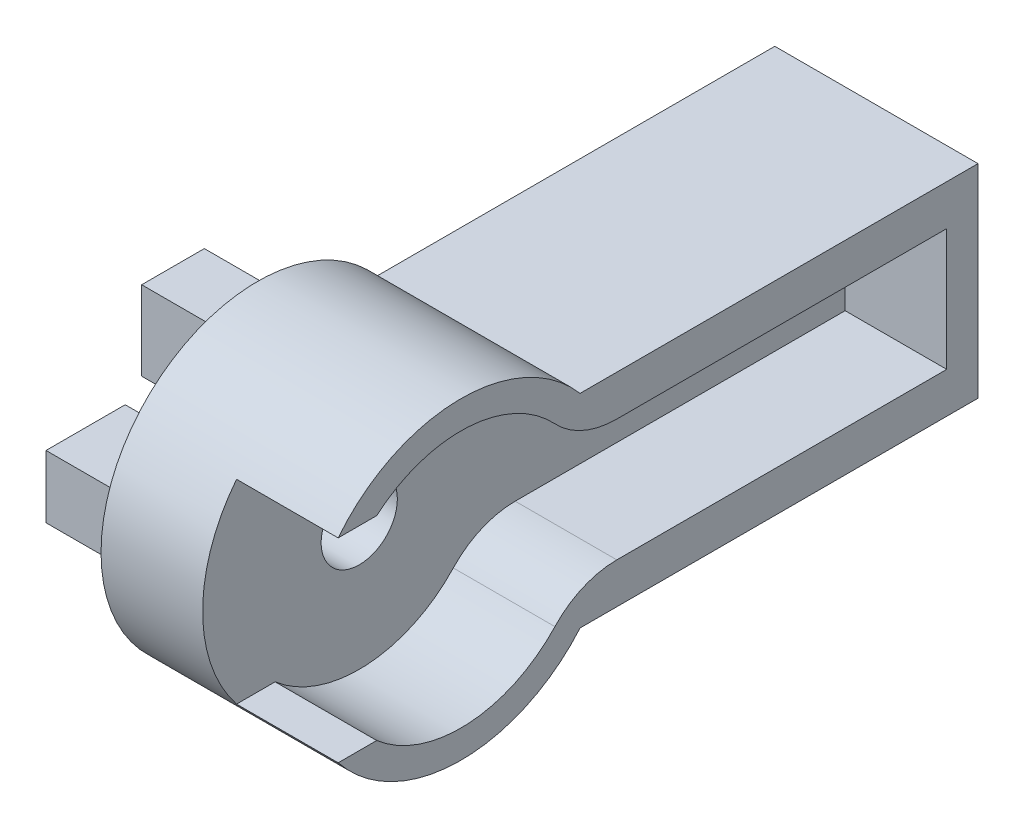
ISO-10303-21;
HEADER;
FILE_DESCRIPTION(('STEP AP214'),'2;1');
FILE_NAME('part.step','',(''),(''),'','','');
FILE_SCHEMA(('AUTOMOTIVE_DESIGN { 1 0 10303 214 1 1 1 1 }'));
ENDSEC;
DATA;
#1=APPLICATION_CONTEXT('core data for automotive mechanical design processes');
#2=APPLICATION_PROTOCOL_DEFINITION('international standard','automotive_design',2000,#1);
#3=PRODUCT_CONTEXT('',#1,'mechanical');
#4=PRODUCT('Part','Part','',(#3));
#5=PRODUCT_RELATED_PRODUCT_CATEGORY('part','',(#4));
#6=PRODUCT_DEFINITION_FORMATION('','',#4);
#7=PRODUCT_DEFINITION_CONTEXT('part definition',#1,'design');
#8=PRODUCT_DEFINITION('design','',#6,#7);
#9=PRODUCT_DEFINITION_SHAPE('','',#8);
#10=(LENGTH_UNIT() NAMED_UNIT(*) SI_UNIT(.MILLI.,.METRE.));
#11=(NAMED_UNIT(*) PLANE_ANGLE_UNIT() SI_UNIT($,.RADIAN.));
#12=(NAMED_UNIT(*) SI_UNIT($,.STERADIAN.) SOLID_ANGLE_UNIT());
#13=UNCERTAINTY_MEASURE_WITH_UNIT(LENGTH_MEASURE(1.E-05),#10,'distance_accuracy_value','');
#14=(GEOMETRIC_REPRESENTATION_CONTEXT(3) GLOBAL_UNCERTAINTY_ASSIGNED_CONTEXT((#13)) GLOBAL_UNIT_ASSIGNED_CONTEXT((#10,
#11,#12)) REPRESENTATION_CONTEXT('',''));
#15=CARTESIAN_POINT('',(0.,0.,0.));
#16=DIRECTION('',(0.,0.,1.));
#17=DIRECTION('',(1.,0.,0.));
#18=AXIS2_PLACEMENT_3D('',#15,#16,#17);
#19=CARTESIAN_POINT('',(-5.,0.,0.));
#20=DIRECTION('',(-1.,0.,0.));
#21=DIRECTION('',(0.,0.,1.));
#22=AXIS2_PLACEMENT_3D('',#19,#20,#21);
#23=PLANE('',#22);
#24=CARTESIAN_POINT('',(-5.,0.,0.));
#25=DIRECTION('',(-1.,0.,0.));
#26=DIRECTION('',(0.,0.,1.));
#27=AXIS2_PLACEMENT_3D('',#24,#25,#26);
#28=CIRCLE('',#27,3.375);
#29=CARTESIAN_POINT('',(-5.,2.82278674362765,1.85));
#30=VERTEX_POINT('',#29);
#31=CARTESIAN_POINT('',(-5.,2.82278674362765,-1.85));
#32=VERTEX_POINT('',#31);
#33=EDGE_CURVE('E12',#30,#32,#28,.T.);
#34=ORIENTED_EDGE('',*,*,#33,.F.);
#35=DIRECTION('',(0.,-1.,0.));
#36=VECTOR('',#35,1.);
#37=CARTESIAN_POINT('',(-5.,0.,1.85));
#38=LINE('',#37,#36);
#39=CARTESIAN_POINT('',(-5.,7.5,1.85));
#40=VERTEX_POINT('',#39);
#41=EDGE_CURVE('E353',#40,#30,#38,.T.);
#42=ORIENTED_EDGE('',*,*,#41,.F.);
#43=DIRECTION('',(0.,0.,1.));
#44=VECTOR('',#43,1.);
#45=CARTESIAN_POINT('',(-5.,7.5,0.));
#46=LINE('',#45,#44);
#47=CARTESIAN_POINT('',(-5.,7.5,-1.85));
#48=VERTEX_POINT('',#47);
#49=EDGE_CURVE('E359',#48,#40,#46,.T.);
#50=ORIENTED_EDGE('',*,*,#49,.F.);
#51=DIRECTION('',(0.,-1.,0.));
#52=VECTOR('',#51,1.);
#53=CARTESIAN_POINT('',(-5.,0.,-1.85));
#54=LINE('',#53,#52);
#55=EDGE_CURVE('E368',#48,#32,#54,.T.);
#56=ORIENTED_EDGE('',*,*,#55,.T.);
#57=EDGE_LOOP('',(#34,#42,#50,#56));
#58=FACE_BOUND('',#57,.T.);
#59=ADVANCED_FACE('F131',(#58),#23,.T.);
#60=CARTESIAN_POINT('',(-5.,1.85,-2.82278674362765));
#61=VERTEX_POINT('',#60);
#62=CARTESIAN_POINT('',(-5.,-1.85,-2.82278674362765));
#63=VERTEX_POINT('',#62);
#64=EDGE_CURVE('E141',#61,#63,#28,.T.);
#65=ORIENTED_EDGE('',*,*,#64,.F.);
#66=DIRECTION('',(0.,0.,1.));
#67=VECTOR('',#66,1.);
#68=CARTESIAN_POINT('',(-5.,1.85,0.));
#69=LINE('',#68,#67);
#70=CARTESIAN_POINT('',(-5.,1.85,-7.5));
#71=VERTEX_POINT('',#70);
#72=EDGE_CURVE('E372',#71,#61,#69,.T.);
#73=ORIENTED_EDGE('',*,*,#72,.F.);
#74=DIRECTION('',(0.,-1.,0.));
#75=VECTOR('',#74,1.);
#76=CARTESIAN_POINT('',(-5.,0.,-7.5));
#77=LINE('',#76,#75);
#78=CARTESIAN_POINT('',(-5.,-1.85,-7.5));
#79=VERTEX_POINT('',#78);
#80=EDGE_CURVE('E376',#71,#79,#77,.T.);
#81=ORIENTED_EDGE('',*,*,#80,.T.);
#82=DIRECTION('',(0.,0.,1.));
#83=VECTOR('',#82,1.);
#84=CARTESIAN_POINT('',(-5.,-1.85,0.));
#85=LINE('',#84,#83);
#86=EDGE_CURVE('E379',#79,#63,#85,.T.);
#87=ORIENTED_EDGE('',*,*,#86,.T.);
#88=EDGE_LOOP('',(#65,#73,#81,#87));
#89=FACE_BOUND('',#88,.T.);
#90=ADVANCED_FACE('F687',(#89),#23,.T.);
#91=CARTESIAN_POINT('',(-5.,-2.82278674362765,-1.85));
#92=VERTEX_POINT('',#91);
#93=CARTESIAN_POINT('',(-5.,-2.82278674362765,1.85));
#94=VERTEX_POINT('',#93);
#95=EDGE_CURVE('E335',#92,#94,#28,.T.);
#96=ORIENTED_EDGE('',*,*,#95,.F.);
#97=DIRECTION('',(0.,-1.,0.));
#98=VECTOR('',#97,1.);
#99=CARTESIAN_POINT('',(-5.,0.,-1.85));
#100=LINE('',#99,#98);
#101=CARTESIAN_POINT('',(-5.,-7.5,-1.85));
#102=VERTEX_POINT('',#101);
#103=EDGE_CURVE('E383',#92,#102,#100,.T.);
#104=ORIENTED_EDGE('',*,*,#103,.T.);
#105=DIRECTION('',(0.,0.,1.));
#106=VECTOR('',#105,1.);
#107=CARTESIAN_POINT('',(-5.,-7.5,0.));
#108=LINE('',#107,#106);
#109=CARTESIAN_POINT('',(-5.,-7.5,1.85));
#110=VERTEX_POINT('',#109);
#111=EDGE_CURVE('E386',#102,#110,#108,.T.);
#112=ORIENTED_EDGE('',*,*,#111,.T.);
#113=DIRECTION('',(0.,-1.,0.));
#114=VECTOR('',#113,1.);
#115=CARTESIAN_POINT('',(-5.,0.,1.85));
#116=LINE('',#115,#114);
#117=EDGE_CURVE('E390',#94,#110,#116,.T.);
#118=ORIENTED_EDGE('',*,*,#117,.F.);
#119=EDGE_LOOP('',(#96,#104,#112,#118));
#120=FACE_BOUND('',#119,.T.);
#121=ADVANCED_FACE('F694',(#120),#23,.T.);
#122=CARTESIAN_POINT('',(12.,0.,0.));
#123=DIRECTION('',(1.,0.,0.));
#124=DIRECTION('',(0.,0.,-1.));
#125=AXIS2_PLACEMENT_3D('',#122,#123,#124);
#126=PLANE('',#125);
#127=CARTESIAN_POINT('',(12.,0.,0.));
#128=DIRECTION('',(1.,0.,0.));
#129=DIRECTION('',(0.,0.,-1.));
#130=AXIS2_PLACEMENT_3D('',#127,#128,#129);
#131=CIRCLE('',#130,7.6);
#132=CARTESIAN_POINT('',(12.,5.18730158730159,-5.55444886936395));
#133=VERTEX_POINT('',#132);
#134=CARTESIAN_POINT('',(12.,5.75,4.9696579359147));
#135=VERTEX_POINT('',#134);
#136=EDGE_CURVE('E467',#133,#135,#131,.T.);
#137=ORIENTED_EDGE('',*,*,#136,.F.);
#138=CARTESIAN_POINT('',(12.,8.6,-9.20869154657707));
#139=DIRECTION('',(1.,0.,0.));
#140=DIRECTION('',(0.,0.,-1.));
#141=AXIS2_PLACEMENT_3D('',#138,#139,#140);
#142=CIRCLE('',#141,5.);
#143=CARTESIAN_POINT('',(12.,3.6,-9.20869154657707));
#144=VERTEX_POINT('',#143);
#145=EDGE_CURVE('E603',#133,#144,#142,.T.);
#146=ORIENTED_EDGE('',*,*,#145,.T.);
#147=DIRECTION('',(0.,0.,-1.));
#148=VECTOR('',#147,1.);
#149=CARTESIAN_POINT('',(12.,3.6,0.));
#150=LINE('',#149,#148);
#151=CARTESIAN_POINT('',(12.,3.6,-28.6932802122726));
#152=VERTEX_POINT('',#151);
#153=EDGE_CURVE('E495',#144,#152,#150,.T.);
#154=ORIENTED_EDGE('',*,*,#153,.T.);
#155=DIRECTION('',(0.,-1.,0.));
#156=VECTOR('',#155,1.);
#157=CARTESIAN_POINT('',(12.,0.,-28.6932802122726));
#158=LINE('',#157,#156);
#159=CARTESIAN_POINT('',(12.,-3.6,-28.6932802122726));
#160=VERTEX_POINT('',#159);
#161=EDGE_CURVE('E487',#152,#160,#158,.T.);
#162=ORIENTED_EDGE('',*,*,#161,.T.);
#163=DIRECTION('',(0.,0.,-1.));
#164=VECTOR('',#163,1.);
#165=CARTESIAN_POINT('',(12.,-3.6,0.));
#166=LINE('',#165,#164);
#167=CARTESIAN_POINT('',(12.,-3.6,-9.20869154657707));
#168=VERTEX_POINT('',#167);
#169=EDGE_CURVE('E498',#168,#160,#166,.T.);
#170=ORIENTED_EDGE('',*,*,#169,.F.);
#171=CARTESIAN_POINT('',(12.,-8.6,-9.20869154657707));
#172=DIRECTION('',(1.,0.,0.));
#173=DIRECTION('',(0.,0.,-1.));
#174=AXIS2_PLACEMENT_3D('',#171,#172,#173);
#175=CIRCLE('',#174,5.);
#176=CARTESIAN_POINT('',(12.,-5.18730158730159,-5.55444886936395));
#177=VERTEX_POINT('',#176);
#178=EDGE_CURVE('E600',#168,#177,#175,.T.);
#179=ORIENTED_EDGE('',*,*,#178,.T.);
#180=CARTESIAN_POINT('',(12.,-5.75,4.9696579359147));
#181=VERTEX_POINT('',#180);
#182=EDGE_CURVE('E539',#181,#177,#131,.T.);
#183=ORIENTED_EDGE('',*,*,#182,.F.);
#184=DIRECTION('',(0.,0.,1.));
#185=VECTOR('',#184,1.);
#186=CARTESIAN_POINT('',(12.,-5.75,4.9696579359147));
#187=LINE('',#186,#185);
#188=CARTESIAN_POINT('',(12.,-5.75,7.24568837309472));
#189=VERTEX_POINT('',#188);
#190=EDGE_CURVE('E523',#181,#189,#187,.T.);
#191=ORIENTED_EDGE('',*,*,#190,.T.);
#192=CARTESIAN_POINT('',(12.,0.,0.));
#193=DIRECTION('',(1.,0.,0.));
#194=DIRECTION('',(0.,0.,-1.));
#195=AXIS2_PLACEMENT_3D('',#192,#193,#194);
#196=CIRCLE('',#195,9.25);
#197=CARTESIAN_POINT('',(12.,-6.,-7.04006392016436));
#198=VERTEX_POINT('',#197);
#199=EDGE_CURVE('E583',#189,#198,#196,.T.);
#200=ORIENTED_EDGE('',*,*,#199,.T.);
#201=DIRECTION('',(0.,0.,-1.));
#202=VECTOR('',#201,1.);
#203=CARTESIAN_POINT('',(12.,-6.,0.));
#204=LINE('',#203,#202);
#205=CARTESIAN_POINT('',(12.,-6.,-30.5400639201644));
#206=VERTEX_POINT('',#205);
#207=EDGE_CURVE('E543',#198,#206,#204,.T.);
#208=ORIENTED_EDGE('',*,*,#207,.T.);
#209=DIRECTION('',(0.,-1.,0.));
#210=VECTOR('',#209,1.);
#211=CARTESIAN_POINT('',(12.,0.,-30.5400639201644));
#212=LINE('',#211,#210);
#213=CARTESIAN_POINT('',(12.,6.,-30.5400639201644));
#214=VERTEX_POINT('',#213);
#215=EDGE_CURVE('E546',#214,#206,#212,.T.);
#216=ORIENTED_EDGE('',*,*,#215,.F.);
#217=DIRECTION('',(0.,0.,-1.));
#218=VECTOR('',#217,1.);
#219=CARTESIAN_POINT('',(12.,6.,0.));
#220=LINE('',#219,#218);
#221=CARTESIAN_POINT('',(12.,6.,-7.04006392016436));
#222=VERTEX_POINT('',#221);
#223=EDGE_CURVE('E551',#222,#214,#220,.T.);
#224=ORIENTED_EDGE('',*,*,#223,.F.);
#225=CARTESIAN_POINT('',(12.,5.75,7.24568837309472));
#226=VERTEX_POINT('',#225);
#227=EDGE_CURVE('E561',#222,#226,#196,.T.);
#228=ORIENTED_EDGE('',*,*,#227,.T.);
#229=DIRECTION('',(0.,0.,1.));
#230=VECTOR('',#229,1.);
#231=CARTESIAN_POINT('',(12.,5.75,4.9696579359147));
#232=LINE('',#231,#230);
#233=EDGE_CURVE('E518',#135,#226,#232,.T.);
#234=ORIENTED_EDGE('',*,*,#233,.F.);
#235=EDGE_LOOP('',(#137,#146,#154,#162,#170,#179,#183,#191,#200,#208,#216,#224,#228,#234));
#236=FACE_BOUND('',#235,.T.);
#237=ADVANCED_FACE('F636',(#236),#126,.T.);
#238=CARTESIAN_POINT('',(12.,0.,0.));
#239=DIRECTION('',(-1.,0.,0.));
#240=DIRECTION('',(0.,0.,1.));
#241=AXIS2_PLACEMENT_3D('',#238,#239,#240);
#242=CYLINDRICAL_SURFACE('',#241,9.25);
#243=DIRECTION('',(-1.,0.,0.));
#244=VECTOR('',#243,1.);
#245=CARTESIAN_POINT('',(12.,-5.75,7.24568837309472));
#246=LINE('',#245,#244);
#247=CARTESIAN_POINT('',(6.,-5.75,7.24568837309472));
#248=VERTEX_POINT('',#247);
#249=EDGE_CURVE('E593',#248,#189,#246,.F.);
#250=ORIENTED_EDGE('',*,*,#249,.F.);
#251=CARTESIAN_POINT('',(6.,0.,0.));
#252=DIRECTION('',(1.,0.,0.));
#253=DIRECTION('',(0.,0.,-1.));
#254=AXIS2_PLACEMENT_3D('',#251,#252,#253);
#255=CIRCLE('',#254,9.25);
#256=CARTESIAN_POINT('',(6.,5.75,7.24568837309472));
#257=VERTEX_POINT('',#256);
#258=EDGE_CURVE('E590',#257,#248,#255,.T.);
#259=ORIENTED_EDGE('',*,*,#258,.F.);
#260=DIRECTION('',(-1.,0.,0.));
#261=VECTOR('',#260,1.);
#262=CARTESIAN_POINT('',(12.,5.75,7.24568837309472));
#263=LINE('',#262,#261);
#264=EDGE_CURVE('E579',#257,#226,#263,.F.);
#265=ORIENTED_EDGE('',*,*,#264,.T.);
#266=ORIENTED_EDGE('',*,*,#227,.F.);
#267=DIRECTION('',(-1.,0.,0.));
#268=VECTOR('',#267,1.);
#269=CARTESIAN_POINT('',(12.,6.,-7.04006392016436));
#270=LINE('',#269,#268);
#271=CARTESIAN_POINT('',(0.,6.,-7.04006392016436));
#272=VERTEX_POINT('',#271);
#273=EDGE_CURVE('E555',#222,#272,#270,.T.);
#274=ORIENTED_EDGE('',*,*,#273,.T.);
#275=CARTESIAN_POINT('',(0.,0.,0.));
#276=DIRECTION('',(1.,0.,0.));
#277=DIRECTION('',(0.,0.,-1.));
#278=AXIS2_PLACEMENT_3D('',#275,#276,#277);
#279=CIRCLE('',#278,9.25);
#280=CARTESIAN_POINT('',(0.,-6.,-7.04006392016436));
#281=VERTEX_POINT('',#280);
#282=EDGE_CURVE('E509',#272,#281,#279,.T.);
#283=ORIENTED_EDGE('',*,*,#282,.T.);
#284=DIRECTION('',(-1.,0.,0.));
#285=VECTOR('',#284,1.);
#286=CARTESIAN_POINT('',(12.,-6.,-7.04006392016436));
#287=LINE('',#286,#285);
#288=EDGE_CURVE('E576',#198,#281,#287,.T.);
#289=ORIENTED_EDGE('',*,*,#288,.F.);
#290=ORIENTED_EDGE('',*,*,#199,.F.);
#291=EDGE_LOOP('',(#250,#259,#265,#266,#274,#283,#289,#290));
#292=FACE_BOUND('',#291,.T.);
#293=ADVANCED_FACE('F646',(#292),#242,.T.);
#294=CARTESIAN_POINT('',(0.,0.,0.));
#295=DIRECTION('',(1.,0.,0.));
#296=DIRECTION('',(0.,0.,-1.));
#297=AXIS2_PLACEMENT_3D('',#294,#295,#296);
#298=PLANE('',#297);
#299=CARTESIAN_POINT('',(0.,0.,0.));
#300=DIRECTION('',(1.,0.,0.));
#301=DIRECTION('',(0.,0.,-1.));
#302=AXIS2_PLACEMENT_3D('',#299,#300,#301);
#303=CIRCLE('',#302,3.375);
#304=CARTESIAN_POINT('',(0.,2.82278674362765,1.85));
#305=VERTEX_POINT('',#304);
#306=CARTESIAN_POINT('',(0.,2.82278674362765,-1.85));
#307=VERTEX_POINT('',#306);
#308=EDGE_CURVE('E762',#305,#307,#303,.F.);
#309=ORIENTED_EDGE('',*,*,#308,.T.);
#310=DIRECTION('',(0.,-1.,0.));
#311=VECTOR('',#310,1.);
#312=CARTESIAN_POINT('',(0.,0.,-1.85));
#313=LINE('',#312,#311);
#314=CARTESIAN_POINT('',(0.,7.5,-1.85));
#315=VERTEX_POINT('',#314);
#316=EDGE_CURVE('E409',#315,#307,#313,.T.);
#317=ORIENTED_EDGE('',*,*,#316,.F.);
#318=DIRECTION('',(0.,0.,1.));
#319=VECTOR('',#318,1.);
#320=CARTESIAN_POINT('',(0.,7.5,0.));
#321=LINE('',#320,#319);
#322=CARTESIAN_POINT('',(0.,7.5,1.85));
#323=VERTEX_POINT('',#322);
#324=EDGE_CURVE('E405',#315,#323,#321,.T.);
#325=ORIENTED_EDGE('',*,*,#324,.T.);
#326=DIRECTION('',(0.,-1.,0.));
#327=VECTOR('',#326,1.);
#328=CARTESIAN_POINT('',(0.,0.,1.85));
#329=LINE('',#328,#327);
#330=EDGE_CURVE('E401',#323,#305,#329,.T.);
#331=ORIENTED_EDGE('',*,*,#330,.T.);
#332=EDGE_LOOP('',(#309,#317,#325,#331));
#333=FACE_BOUND('',#332,.T.);
#334=CARTESIAN_POINT('',(0.,-1.85,2.82278674362765));
#335=VERTEX_POINT('',#334);
#336=CARTESIAN_POINT('',(0.,1.85,2.82278674362765));
#337=VERTEX_POINT('',#336);
#338=EDGE_CURVE('E779',#335,#337,#303,.F.);
#339=ORIENTED_EDGE('',*,*,#338,.T.);
#340=DIRECTION('',(0.,0.,1.));
#341=VECTOR('',#340,1.);
#342=CARTESIAN_POINT('',(0.,1.85,0.));
#343=LINE('',#342,#341);
#344=CARTESIAN_POINT('',(0.,1.85,7.5));
#345=VERTEX_POINT('',#344);
#346=EDGE_CURVE('E343',#337,#345,#343,.T.);
#347=ORIENTED_EDGE('',*,*,#346,.T.);
#348=DIRECTION('',(0.,-1.,0.));
#349=VECTOR('',#348,1.);
#350=CARTESIAN_POINT('',(0.,0.,7.5));
#351=LINE('',#350,#349);
#352=CARTESIAN_POINT('',(0.,-1.85,7.5));
#353=VERTEX_POINT('',#352);
#354=EDGE_CURVE('E354',#345,#353,#351,.T.);
#355=ORIENTED_EDGE('',*,*,#354,.T.);
#356=DIRECTION('',(0.,0.,1.));
#357=VECTOR('',#356,1.);
#358=CARTESIAN_POINT('',(0.,-1.85,0.));
#359=LINE('',#358,#357);
#360=EDGE_CURVE('E155',#335,#353,#359,.T.);
#361=ORIENTED_EDGE('',*,*,#360,.F.);
#362=EDGE_LOOP('',(#339,#347,#355,#361));
#363=FACE_BOUND('',#362,.T.);
#364=CARTESIAN_POINT('',(0.,-2.82278674362765,-1.85));
#365=VERTEX_POINT('',#364);
#366=CARTESIAN_POINT('',(0.,-2.82278674362765,1.85));
#367=VERTEX_POINT('',#366);
#368=EDGE_CURVE('E744',#365,#367,#303,.F.);
#369=ORIENTED_EDGE('',*,*,#368,.T.);
#370=DIRECTION('',(0.,-1.,0.));
#371=VECTOR('',#370,1.);
#372=CARTESIAN_POINT('',(0.,0.,1.85));
#373=LINE('',#372,#371);
#374=CARTESIAN_POINT('',(0.,-7.5,1.85));
#375=VERTEX_POINT('',#374);
#376=EDGE_CURVE('E431',#367,#375,#373,.T.);
#377=ORIENTED_EDGE('',*,*,#376,.T.);
#378=DIRECTION('',(0.,0.,1.));
#379=VECTOR('',#378,1.);
#380=CARTESIAN_POINT('',(0.,-7.5,0.));
#381=LINE('',#380,#379);
#382=CARTESIAN_POINT('',(0.,-7.5,-1.85));
#383=VERTEX_POINT('',#382);
#384=EDGE_CURVE('E427',#383,#375,#381,.T.);
#385=ORIENTED_EDGE('',*,*,#384,.F.);
#386=DIRECTION('',(0.,-1.,0.));
#387=VECTOR('',#386,1.);
#388=CARTESIAN_POINT('',(0.,0.,-1.85));
#389=LINE('',#388,#387);
#390=EDGE_CURVE('E424',#365,#383,#389,.T.);
#391=ORIENTED_EDGE('',*,*,#390,.F.);
#392=EDGE_LOOP('',(#369,#377,#385,#391));
#393=FACE_BOUND('',#392,.T.);
#394=DIRECTION('',(0.,0.,1.));
#395=VECTOR('',#394,1.);
#396=CARTESIAN_POINT('',(0.,1.85,0.));
#397=LINE('',#396,#395);
#398=CARTESIAN_POINT('',(0.,1.85,-7.5));
#399=VERTEX_POINT('',#398);
#400=CARTESIAN_POINT('',(0.,1.85,-2.82278674362765));
#401=VERTEX_POINT('',#400);
#402=EDGE_CURVE('E413',#399,#401,#397,.T.);
#403=ORIENTED_EDGE('',*,*,#402,.T.);
#404=CARTESIAN_POINT('',(0.,-1.85,-2.82278674362765));
#405=VERTEX_POINT('',#404);
#406=EDGE_CURVE('E780',#401,#405,#303,.F.);
#407=ORIENTED_EDGE('',*,*,#406,.T.);
#408=DIRECTION('',(0.,0.,1.));
#409=VECTOR('',#408,1.);
#410=CARTESIAN_POINT('',(0.,-1.85,0.));
#411=LINE('',#410,#409);
#412=CARTESIAN_POINT('',(0.,-1.85,-7.5));
#413=VERTEX_POINT('',#412);
#414=EDGE_CURVE('E420',#413,#405,#411,.T.);
#415=ORIENTED_EDGE('',*,*,#414,.F.);
#416=DIRECTION('',(0.,-1.,0.));
#417=VECTOR('',#416,1.);
#418=CARTESIAN_POINT('',(0.,0.,-7.5));
#419=LINE('',#418,#417);
#420=EDGE_CURVE('E417',#399,#413,#419,.T.);
#421=ORIENTED_EDGE('',*,*,#420,.F.);
#422=EDGE_LOOP('',(#403,#407,#415,#421));
#423=FACE_BOUND('',#422,.T.);
#424=CARTESIAN_POINT('',(0.,0.,-20.5));
#425=DIRECTION('',(1.,0.,0.));
#426=DIRECTION('',(0.,0.,-1.));
#427=AXIS2_PLACEMENT_3D('',#424,#425,#426);
#428=CIRCLE('',#427,1.65);
#429=CARTESIAN_POINT('',(0.,0.,-22.15));
#430=VERTEX_POINT('',#429);
#431=EDGE_CURVE('E468',#430,#430,#428,.F.);
#432=ORIENTED_EDGE('',*,*,#431,.F.);
#433=EDGE_LOOP('',(#432));
#434=FACE_BOUND('',#433,.T.);
#435=CARTESIAN_POINT('',(0.,0.,-24.5));
#436=DIRECTION('',(1.,0.,0.));
#437=DIRECTION('',(0.,0.,-1.));
#438=AXIS2_PLACEMENT_3D('',#435,#436,#437);
#439=CIRCLE('',#438,1.65);
#440=CARTESIAN_POINT('',(0.,0.,-26.15));
#441=VERTEX_POINT('',#440);
#442=EDGE_CURVE('E473',#441,#441,#439,.F.);
#443=ORIENTED_EDGE('',*,*,#442,.F.);
#444=EDGE_LOOP('',(#443));
#445=FACE_BOUND('',#444,.T.);
#446=DIRECTION('',(0.,0.,-1.));
#447=VECTOR('',#446,1.);
#448=CARTESIAN_POINT('',(0.,-6.,0.));
#449=LINE('',#448,#447);
#450=CARTESIAN_POINT('',(0.,-6.,-30.5400639201644));
#451=VERTEX_POINT('',#450);
#452=EDGE_CURVE('E556',#281,#451,#449,.T.);
#453=ORIENTED_EDGE('',*,*,#452,.F.);
#454=ORIENTED_EDGE('',*,*,#282,.F.);
#455=DIRECTION('',(0.,0.,-1.));
#456=VECTOR('',#455,1.);
#457=CARTESIAN_POINT('',(0.,6.,0.));
#458=LINE('',#457,#456);
#459=CARTESIAN_POINT('',(0.,6.,-30.5400639201644));
#460=VERTEX_POINT('',#459);
#461=EDGE_CURVE('E547',#272,#460,#458,.T.);
#462=ORIENTED_EDGE('',*,*,#461,.T.);
#463=DIRECTION('',(0.,-1.,0.));
#464=VECTOR('',#463,1.);
#465=CARTESIAN_POINT('',(0.,0.,-30.5400639201644));
#466=LINE('',#465,#464);
#467=EDGE_CURVE('E560',#460,#451,#466,.T.);
#468=ORIENTED_EDGE('',*,*,#467,.T.);
#469=EDGE_LOOP('',(#453,#454,#462,#468));
#470=FACE_BOUND('',#469,.T.);
#471=CARTESIAN_POINT('',(0.,0.,0.));
#472=DIRECTION('',(1.,0.,0.));
#473=DIRECTION('',(0.,0.,-1.));
#474=AXIS2_PLACEMENT_3D('',#471,#472,#473);
#475=CIRCLE('',#474,2.25);
#476=CARTESIAN_POINT('',(0.,0.,-2.25));
#477=VERTEX_POINT('',#476);
#478=EDGE_CURVE('E345',#477,#477,#475,.F.);
#479=ORIENTED_EDGE('',*,*,#478,.F.);
#480=EDGE_LOOP('',(#479));
#481=FACE_BOUND('',#480,.T.);
#482=ADVANCED_FACE('F776',(#333,#363,#393,#423,#434,#445,#470,#481),#298,.F.);
#483=CARTESIAN_POINT('',(12.,-6.,0.));
#484=DIRECTION('',(0.,1.,0.));
#485=DIRECTION('',(0.,0.,1.));
#486=AXIS2_PLACEMENT_3D('',#483,#484,#485);
#487=PLANE('',#486);
#488=ORIENTED_EDGE('',*,*,#452,.T.);
#489=DIRECTION('',(-1.,0.,0.));
#490=VECTOR('',#489,1.);
#491=CARTESIAN_POINT('',(12.,-6.,-30.5400639201644));
#492=LINE('',#491,#490);
#493=EDGE_CURVE('E573',#206,#451,#492,.T.);
#494=ORIENTED_EDGE('',*,*,#493,.F.);
#495=ORIENTED_EDGE('',*,*,#207,.F.);
#496=ORIENTED_EDGE('',*,*,#288,.T.);
#497=EDGE_LOOP('',(#488,#494,#495,#496));
#498=FACE_BOUND('',#497,.T.);
#499=ADVANCED_FACE('F813',(#498),#487,.F.);
#500=CARTESIAN_POINT('',(12.,0.,-30.5400639201644));
#501=DIRECTION('',(0.,0.,-1.));
#502=DIRECTION('',(-1.,0.,0.));
#503=AXIS2_PLACEMENT_3D('',#500,#501,#502);
#504=PLANE('',#503);
#505=ORIENTED_EDGE('',*,*,#467,.F.);
#506=DIRECTION('',(-1.,0.,0.));
#507=VECTOR('',#506,1.);
#508=CARTESIAN_POINT('',(12.,6.,-30.5400639201644));
#509=LINE('',#508,#507);
#510=EDGE_CURVE('E570',#214,#460,#509,.T.);
#511=ORIENTED_EDGE('',*,*,#510,.F.);
#512=ORIENTED_EDGE('',*,*,#215,.T.);
#513=ORIENTED_EDGE('',*,*,#493,.T.);
#514=EDGE_LOOP('',(#505,#511,#512,#513));
#515=FACE_BOUND('',#514,.T.);
#516=ADVANCED_FACE('F815',(#515),#504,.T.);
#517=CARTESIAN_POINT('',(12.,6.,0.));
#518=DIRECTION('',(0.,1.,0.));
#519=DIRECTION('',(0.,0.,1.));
#520=AXIS2_PLACEMENT_3D('',#517,#518,#519);
#521=PLANE('',#520);
#522=ORIENTED_EDGE('',*,*,#461,.F.);
#523=ORIENTED_EDGE('',*,*,#273,.F.);
#524=ORIENTED_EDGE('',*,*,#223,.T.);
#525=ORIENTED_EDGE('',*,*,#510,.T.);
#526=EDGE_LOOP('',(#522,#523,#524,#525));
#527=FACE_BOUND('',#526,.T.);
#528=ADVANCED_FACE('F835',(#527),#521,.T.);
#529=CARTESIAN_POINT('',(6.,0.,0.));
#530=DIRECTION('',(1.,0.,0.));
#531=DIRECTION('',(0.,0.,-1.));
#532=AXIS2_PLACEMENT_3D('',#529,#530,#531);
#533=PLANE('',#532);
#534=CARTESIAN_POINT('',(6.,0.,0.));
#535=DIRECTION('',(1.,0.,0.));
#536=DIRECTION('',(0.,0.,-1.));
#537=AXIS2_PLACEMENT_3D('',#534,#535,#536);
#538=CIRCLE('',#537,2.25);
#539=CARTESIAN_POINT('',(6.,0.,-2.25));
#540=VERTEX_POINT('',#539);
#541=EDGE_CURVE('E463',#540,#540,#538,.T.);
#542=ORIENTED_EDGE('',*,*,#541,.F.);
#543=EDGE_LOOP('',(#542));
#544=FACE_BOUND('',#543,.T.);
#545=CARTESIAN_POINT('',(6.,0.,-20.5));
#546=DIRECTION('',(1.,0.,0.));
#547=DIRECTION('',(0.,0.,-1.));
#548=AXIS2_PLACEMENT_3D('',#545,#546,#547);
#549=CIRCLE('',#548,1.65);
#550=CARTESIAN_POINT('',(6.,0.,-22.15));
#551=VERTEX_POINT('',#550);
#552=EDGE_CURVE('E469',#551,#551,#549,.T.);
#553=ORIENTED_EDGE('',*,*,#552,.F.);
#554=EDGE_LOOP('',(#553));
#555=FACE_BOUND('',#554,.T.);
#556=CARTESIAN_POINT('',(6.,0.,-24.5));
#557=DIRECTION('',(1.,0.,0.));
#558=DIRECTION('',(0.,0.,-1.));
#559=AXIS2_PLACEMENT_3D('',#556,#557,#558);
#560=CIRCLE('',#559,1.65);
#561=CARTESIAN_POINT('',(6.,0.,-26.15));
#562=VERTEX_POINT('',#561);
#563=EDGE_CURVE('E462',#562,#562,#560,.T.);
#564=ORIENTED_EDGE('',*,*,#563,.F.);
#565=EDGE_LOOP('',(#564));
#566=FACE_BOUND('',#565,.T.);
#567=ORIENTED_EDGE('',*,*,#258,.T.);
#568=DIRECTION('',(0.,0.,1.));
#569=VECTOR('',#568,1.);
#570=CARTESIAN_POINT('',(6.,-5.75,4.9696579359147));
#571=LINE('',#570,#569);
#572=CARTESIAN_POINT('',(6.,-5.75,4.9696579359147));
#573=VERTEX_POINT('',#572);
#574=EDGE_CURVE('E513',#573,#248,#571,.T.);
#575=ORIENTED_EDGE('',*,*,#574,.F.);
#576=CARTESIAN_POINT('',(6.,0.,0.));
#577=DIRECTION('',(1.,0.,0.));
#578=DIRECTION('',(0.,0.,-1.));
#579=AXIS2_PLACEMENT_3D('',#576,#577,#578);
#580=CIRCLE('',#579,7.6);
#581=CARTESIAN_POINT('',(6.,-5.18730158730159,-5.55444886936395));
#582=VERTEX_POINT('',#581);
#583=EDGE_CURVE('E527',#573,#582,#580,.T.);
#584=ORIENTED_EDGE('',*,*,#583,.T.);
#585=CARTESIAN_POINT('',(6.,-8.6,-9.20869154657707));
#586=DIRECTION('',(1.,0.,0.));
#587=DIRECTION('',(0.,0.,-1.));
#588=AXIS2_PLACEMENT_3D('',#585,#586,#587);
#589=CIRCLE('',#588,5.);
#590=CARTESIAN_POINT('',(6.,-3.6,-9.20869154657707));
#591=VERTEX_POINT('',#590);
#592=EDGE_CURVE('E336',#582,#591,#589,.F.);
#593=ORIENTED_EDGE('',*,*,#592,.T.);
#594=DIRECTION('',(0.,0.,-1.));
#595=VECTOR('',#594,1.);
#596=CARTESIAN_POINT('',(6.,-3.6,0.));
#597=LINE('',#596,#595);
#598=CARTESIAN_POINT('',(6.,-3.6,-28.6932802122726));
#599=VERTEX_POINT('',#598);
#600=EDGE_CURVE('E486',#591,#599,#597,.T.);
#601=ORIENTED_EDGE('',*,*,#600,.T.);
#602=DIRECTION('',(0.,-1.,0.));
#603=VECTOR('',#602,1.);
#604=CARTESIAN_POINT('',(6.,0.,-28.6932802122726));
#605=LINE('',#604,#603);
#606=CARTESIAN_POINT('',(6.,3.6,-28.6932802122726));
#607=VERTEX_POINT('',#606);
#608=EDGE_CURVE('E490',#607,#599,#605,.T.);
#609=ORIENTED_EDGE('',*,*,#608,.F.);
#610=DIRECTION('',(0.,0.,-1.));
#611=VECTOR('',#610,1.);
#612=CARTESIAN_POINT('',(6.,3.6,0.));
#613=LINE('',#612,#611);
#614=CARTESIAN_POINT('',(6.,3.6,-9.20869154657707));
#615=VERTEX_POINT('',#614);
#616=EDGE_CURVE('E483',#615,#607,#613,.T.);
#617=ORIENTED_EDGE('',*,*,#616,.F.);
#618=CARTESIAN_POINT('',(6.,8.6,-9.20869154657707));
#619=DIRECTION('',(1.,0.,0.));
#620=DIRECTION('',(0.,0.,-1.));
#621=AXIS2_PLACEMENT_3D('',#618,#619,#620);
#622=CIRCLE('',#621,5.);
#623=CARTESIAN_POINT('',(6.,5.18730158730159,-5.55444886936395));
#624=VERTEX_POINT('',#623);
#625=EDGE_CURVE('E616',#615,#624,#622,.F.);
#626=ORIENTED_EDGE('',*,*,#625,.T.);
#627=CARTESIAN_POINT('',(6.,5.75,4.9696579359147));
#628=VERTEX_POINT('',#627);
#629=EDGE_CURVE('E538',#624,#628,#580,.T.);
#630=ORIENTED_EDGE('',*,*,#629,.T.);
#631=DIRECTION('',(0.,0.,1.));
#632=VECTOR('',#631,1.);
#633=CARTESIAN_POINT('',(6.,5.75,4.9696579359147));
#634=LINE('',#633,#632);
#635=EDGE_CURVE('E517',#628,#257,#634,.T.);
#636=ORIENTED_EDGE('',*,*,#635,.T.);
#637=EDGE_LOOP('',(#567,#575,#584,#593,#601,#609,#617,#626,#630,#636));
#638=FACE_BOUND('',#637,.T.);
#639=ADVANCED_FACE('F622',(#544,#555,#566,#638),#533,.T.);
#640=CARTESIAN_POINT('',(6.,-5.75,4.9696579359147));
#641=DIRECTION('',(0.,1.,0.));
#642=DIRECTION('',(0.,0.,1.));
#643=AXIS2_PLACEMENT_3D('',#640,#641,#642);
#644=PLANE('',#643);
#645=ORIENTED_EDGE('',*,*,#249,.T.);
#646=ORIENTED_EDGE('',*,*,#190,.F.);
#647=DIRECTION('',(1.,0.,0.));
#648=VECTOR('',#647,1.);
#649=CARTESIAN_POINT('',(6.,-5.75,4.9696579359147));
#650=LINE('',#649,#648);
#651=EDGE_CURVE('E522',#573,#181,#650,.T.);
#652=ORIENTED_EDGE('',*,*,#651,.F.);
#653=ORIENTED_EDGE('',*,*,#574,.T.);
#654=EDGE_LOOP('',(#645,#646,#652,#653));
#655=FACE_BOUND('',#654,.T.);
#656=ADVANCED_FACE('F641',(#655),#644,.T.);
#657=CARTESIAN_POINT('',(6.,5.75,4.9696579359147));
#658=DIRECTION('',(0.,1.,0.));
#659=DIRECTION('',(0.,0.,1.));
#660=AXIS2_PLACEMENT_3D('',#657,#658,#659);
#661=PLANE('',#660);
#662=ORIENTED_EDGE('',*,*,#635,.F.);
#663=DIRECTION('',(1.,0.,0.));
#664=VECTOR('',#663,1.);
#665=CARTESIAN_POINT('',(6.,5.75,4.9696579359147));
#666=LINE('',#665,#664);
#667=EDGE_CURVE('E499',#628,#135,#666,.T.);
#668=ORIENTED_EDGE('',*,*,#667,.T.);
#669=ORIENTED_EDGE('',*,*,#233,.T.);
#670=ORIENTED_EDGE('',*,*,#264,.F.);
#671=EDGE_LOOP('',(#662,#668,#669,#670));
#672=FACE_BOUND('',#671,.T.);
#673=ADVANCED_FACE('F660',(#672),#661,.F.);
#674=CARTESIAN_POINT('',(6.,3.6,0.));
#675=DIRECTION('',(0.,-1.,0.));
#676=DIRECTION('',(0.,0.,-1.));
#677=AXIS2_PLACEMENT_3D('',#674,#675,#676);
#678=PLANE('',#677);
#679=ORIENTED_EDGE('',*,*,#153,.F.);
#680=DIRECTION('',(-1.,0.,0.));
#681=VECTOR('',#680,1.);
#682=CARTESIAN_POINT('',(6.,3.6,-9.20869154657707));
#683=LINE('',#682,#681);
#684=EDGE_CURVE('E606',#144,#615,#683,.T.);
#685=ORIENTED_EDGE('',*,*,#684,.T.);
#686=ORIENTED_EDGE('',*,*,#616,.T.);
#687=DIRECTION('',(1.,0.,0.));
#688=VECTOR('',#687,1.);
#689=CARTESIAN_POINT('',(6.,3.6,-28.6932802122726));
#690=LINE('',#689,#688);
#691=EDGE_CURVE('E505',#607,#152,#690,.T.);
#692=ORIENTED_EDGE('',*,*,#691,.T.);
#693=EDGE_LOOP('',(#679,#685,#686,#692));
#694=FACE_BOUND('',#693,.T.);
#695=ADVANCED_FACE('F673',(#694),#678,.T.);
#696=CARTESIAN_POINT('',(6.,0.,-28.6932802122726));
#697=DIRECTION('',(0.,0.,1.));
#698=DIRECTION('',(1.,0.,0.));
#699=AXIS2_PLACEMENT_3D('',#696,#697,#698);
#700=PLANE('',#699);
#701=ORIENTED_EDGE('',*,*,#161,.F.);
#702=ORIENTED_EDGE('',*,*,#691,.F.);
#703=ORIENTED_EDGE('',*,*,#608,.T.);
#704=DIRECTION('',(1.,0.,0.));
#705=VECTOR('',#704,1.);
#706=CARTESIAN_POINT('',(6.,-3.6,-28.6932802122726));
#707=LINE('',#706,#705);
#708=EDGE_CURVE('E494',#599,#160,#707,.T.);
#709=ORIENTED_EDGE('',*,*,#708,.T.);
#710=EDGE_LOOP('',(#701,#702,#703,#709));
#711=FACE_BOUND('',#710,.T.);
#712=ADVANCED_FACE('F676',(#711),#700,.T.);
#713=CARTESIAN_POINT('',(6.,-3.6,0.));
#714=DIRECTION('',(0.,-1.,0.));
#715=DIRECTION('',(0.,0.,-1.));
#716=AXIS2_PLACEMENT_3D('',#713,#714,#715);
#717=PLANE('',#716);
#718=ORIENTED_EDGE('',*,*,#600,.F.);
#719=DIRECTION('',(1.,0.,0.));
#720=VECTOR('',#719,1.);
#721=CARTESIAN_POINT('',(6.,-3.6,-9.20869154657707));
#722=LINE('',#721,#720);
#723=EDGE_CURVE('E609',#591,#168,#722,.T.);
#724=ORIENTED_EDGE('',*,*,#723,.T.);
#725=ORIENTED_EDGE('',*,*,#169,.T.);
#726=ORIENTED_EDGE('',*,*,#708,.F.);
#727=EDGE_LOOP('',(#718,#724,#725,#726));
#728=FACE_BOUND('',#727,.T.);
#729=ADVANCED_FACE('F631',(#728),#717,.F.);
#730=CARTESIAN_POINT('',(6.,0.,0.));
#731=DIRECTION('',(1.,0.,0.));
#732=DIRECTION('',(0.,0.,-1.));
#733=AXIS2_PLACEMENT_3D('',#730,#731,#732);
#734=CYLINDRICAL_SURFACE('',#733,7.6);
#735=ORIENTED_EDGE('',*,*,#182,.T.);
#736=DIRECTION('',(1.,0.,0.));
#737=VECTOR('',#736,1.);
#738=CARTESIAN_POINT('',(6.,-5.18730158730159,-5.55444886936395));
#739=LINE('',#738,#737);
#740=EDGE_CURVE('E613',#177,#582,#739,.F.);
#741=ORIENTED_EDGE('',*,*,#740,.T.);
#742=ORIENTED_EDGE('',*,*,#583,.F.);
#743=ORIENTED_EDGE('',*,*,#651,.T.);
#744=EDGE_LOOP('',(#735,#741,#742,#743));
#745=FACE_BOUND('',#744,.T.);
#746=ADVANCED_FACE('F638',(#745),#734,.F.);
#747=ORIENTED_EDGE('',*,*,#629,.F.);
#748=DIRECTION('',(1.,0.,0.));
#749=VECTOR('',#748,1.);
#750=CARTESIAN_POINT('',(6.,5.18730158730159,-5.55444886936395));
#751=LINE('',#750,#749);
#752=EDGE_CURVE('E596',#624,#133,#751,.T.);
#753=ORIENTED_EDGE('',*,*,#752,.T.);
#754=ORIENTED_EDGE('',*,*,#136,.T.);
#755=ORIENTED_EDGE('',*,*,#667,.F.);
#756=EDGE_LOOP('',(#747,#753,#754,#755));
#757=FACE_BOUND('',#756,.T.);
#758=ADVANCED_FACE('F655',(#757),#734,.F.);
#759=CARTESIAN_POINT('',(6.,8.6,-9.20869154657707));
#760=DIRECTION('',(1.,0.,0.));
#761=DIRECTION('',(0.,0.,-1.));
#762=AXIS2_PLACEMENT_3D('',#759,#760,#761);
#763=CYLINDRICAL_SURFACE('',#762,5.);
#764=ORIENTED_EDGE('',*,*,#625,.F.);
#765=ORIENTED_EDGE('',*,*,#684,.F.);
#766=ORIENTED_EDGE('',*,*,#145,.F.);
#767=ORIENTED_EDGE('',*,*,#752,.F.);
#768=EDGE_LOOP('',(#764,#765,#766,#767));
#769=FACE_BOUND('',#768,.T.);
#770=ADVANCED_FACE('F668',(#769),#763,.T.);
#771=CARTESIAN_POINT('',(6.,-8.6,-9.20869154657707));
#772=DIRECTION('',(1.,0.,0.));
#773=DIRECTION('',(0.,0.,-1.));
#774=AXIS2_PLACEMENT_3D('',#771,#772,#773);
#775=CYLINDRICAL_SURFACE('',#774,5.);
#776=ORIENTED_EDGE('',*,*,#592,.F.);
#777=ORIENTED_EDGE('',*,*,#740,.F.);
#778=ORIENTED_EDGE('',*,*,#178,.F.);
#779=ORIENTED_EDGE('',*,*,#723,.F.);
#780=EDGE_LOOP('',(#776,#777,#778,#779));
#781=FACE_BOUND('',#780,.T.);
#782=ADVANCED_FACE('F133',(#781),#775,.T.);
#783=CARTESIAN_POINT('',(-6.36396103067893,0.,-24.5));
#784=DIRECTION('',(1.,0.,0.));
#785=DIRECTION('',(0.,0.,-1.));
#786=AXIS2_PLACEMENT_3D('',#783,#784,#785);
#787=CYLINDRICAL_SURFACE('',#786,1.65);
#788=ORIENTED_EDGE('',*,*,#442,.T.);
#789=EDGE_LOOP('',(#788));
#790=FACE_BOUND('',#789,.T.);
#791=ORIENTED_EDGE('',*,*,#563,.T.);
#792=EDGE_LOOP('',(#791));
#793=FACE_BOUND('',#792,.T.);
#794=ADVANCED_FACE('F840',(#790,#793),#787,.F.);
#795=CARTESIAN_POINT('',(-6.36396103067893,0.,-20.5));
#796=DIRECTION('',(1.,0.,0.));
#797=DIRECTION('',(0.,0.,-1.));
#798=AXIS2_PLACEMENT_3D('',#795,#796,#797);
#799=CYLINDRICAL_SURFACE('',#798,1.65);
#800=ORIENTED_EDGE('',*,*,#431,.T.);
#801=EDGE_LOOP('',(#800));
#802=FACE_BOUND('',#801,.T.);
#803=ORIENTED_EDGE('',*,*,#552,.T.);
#804=EDGE_LOOP('',(#803));
#805=FACE_BOUND('',#804,.T.);
#806=ADVANCED_FACE('F829',(#802,#805),#799,.F.);
#807=CARTESIAN_POINT('',(-6.36396103067893,0.,0.));
#808=DIRECTION('',(1.,0.,0.));
#809=DIRECTION('',(0.,0.,-1.));
#810=AXIS2_PLACEMENT_3D('',#807,#808,#809);
#811=CYLINDRICAL_SURFACE('',#810,2.25);
#812=ORIENTED_EDGE('',*,*,#478,.T.);
#813=EDGE_LOOP('',(#812));
#814=FACE_BOUND('',#813,.T.);
#815=ORIENTED_EDGE('',*,*,#541,.T.);
#816=EDGE_LOOP('',(#815));
#817=FACE_BOUND('',#816,.T.);
#818=ADVANCED_FACE('F826',(#814,#817),#811,.F.);
#819=CARTESIAN_POINT('',(-5.,1.85,0.));
#820=DIRECTION('',(0.,1.,0.));
#821=DIRECTION('',(0.,0.,1.));
#822=AXIS2_PLACEMENT_3D('',#819,#820,#821);
#823=PLANE('',#822);
#824=DIRECTION('',(-1.,0.,0.));
#825=VECTOR('',#824,1.);
#826=CARTESIAN_POINT('',(9.54594154601839,1.85,2.82278674362765));
#827=LINE('',#826,#825);
#828=CARTESIAN_POINT('',(-5.,1.85,2.82278674362765));
#829=VERTEX_POINT('',#828);
#830=EDGE_CURVE('E329',#829,#337,#827,.F.);
#831=ORIENTED_EDGE('',*,*,#830,.F.);
#832=DIRECTION('',(0.,0.,1.));
#833=VECTOR('',#832,1.);
#834=CARTESIAN_POINT('',(-5.,1.85,0.));
#835=LINE('',#834,#833);
#836=CARTESIAN_POINT('',(-5.,1.85,7.5));
#837=VERTEX_POINT('',#836);
#838=EDGE_CURVE('E341',#829,#837,#835,.T.);
#839=ORIENTED_EDGE('',*,*,#838,.T.);
#840=DIRECTION('',(1.,0.,0.));
#841=VECTOR('',#840,1.);
#842=CARTESIAN_POINT('',(-5.,1.85,7.5));
#843=LINE('',#842,#841);
#844=EDGE_CURVE('E398',#837,#345,#843,.T.);
#845=ORIENTED_EDGE('',*,*,#844,.T.);
#846=ORIENTED_EDGE('',*,*,#346,.F.);
#847=EDGE_LOOP('',(#831,#839,#845,#846));
#848=FACE_BOUND('',#847,.T.);
#849=ADVANCED_FACE('F339',(#848),#823,.T.);
#850=CARTESIAN_POINT('',(-5.,0.,1.85));
#851=DIRECTION('',(0.,0.,1.));
#852=DIRECTION('',(0.,-1.,0.));
#853=AXIS2_PLACEMENT_3D('',#850,#851,#852);
#854=PLANE('',#853);
#855=DIRECTION('',(-1.,0.,0.));
#856=VECTOR('',#855,1.);
#857=CARTESIAN_POINT('',(9.54594154601839,2.82278674362765,1.85));
#858=LINE('',#857,#856);
#859=EDGE_CURVE('E346',#305,#30,#858,.T.);
#860=ORIENTED_EDGE('',*,*,#859,.F.);
#861=ORIENTED_EDGE('',*,*,#330,.F.);
#862=DIRECTION('',(1.,0.,0.));
#863=VECTOR('',#862,1.);
#864=CARTESIAN_POINT('',(-5.,7.5,1.85));
#865=LINE('',#864,#863);
#866=EDGE_CURVE('E459',#40,#323,#865,.T.);
#867=ORIENTED_EDGE('',*,*,#866,.F.);
#868=ORIENTED_EDGE('',*,*,#41,.T.);
#869=EDGE_LOOP('',(#860,#861,#867,#868));
#870=FACE_BOUND('',#869,.T.);
#871=ADVANCED_FACE('F768',(#870),#854,.T.);
#872=CARTESIAN_POINT('',(-5.,7.5,0.));
#873=DIRECTION('',(0.,1.,0.));
#874=DIRECTION('',(0.,0.,1.));
#875=AXIS2_PLACEMENT_3D('',#872,#873,#874);
#876=PLANE('',#875);
#877=ORIENTED_EDGE('',*,*,#324,.F.);
#878=DIRECTION('',(1.,0.,0.));
#879=VECTOR('',#878,1.);
#880=CARTESIAN_POINT('',(-5.,7.5,-1.85));
#881=LINE('',#880,#879);
#882=EDGE_CURVE('E456',#48,#315,#881,.T.);
#883=ORIENTED_EDGE('',*,*,#882,.F.);
#884=ORIENTED_EDGE('',*,*,#49,.T.);
#885=ORIENTED_EDGE('',*,*,#866,.T.);
#886=EDGE_LOOP('',(#877,#883,#884,#885));
#887=FACE_BOUND('',#886,.T.);
#888=ADVANCED_FACE('F771',(#887),#876,.T.);
#889=CARTESIAN_POINT('',(-5.,0.,-1.85));
#890=DIRECTION('',(0.,0.,1.));
#891=DIRECTION('',(0.,-1.,0.));
#892=AXIS2_PLACEMENT_3D('',#889,#890,#891);
#893=PLANE('',#892);
#894=ORIENTED_EDGE('',*,*,#316,.T.);
#895=DIRECTION('',(-1.,0.,0.));
#896=VECTOR('',#895,1.);
#897=CARTESIAN_POINT('',(9.54594154601839,2.82278674362765,-1.85));
#898=LINE('',#897,#896);
#899=EDGE_CURVE('E754',#307,#32,#898,.T.);
#900=ORIENTED_EDGE('',*,*,#899,.T.);
#901=ORIENTED_EDGE('',*,*,#55,.F.);
#902=ORIENTED_EDGE('',*,*,#882,.T.);
#903=EDGE_LOOP('',(#894,#900,#901,#902));
#904=FACE_BOUND('',#903,.T.);
#905=ADVANCED_FACE('F774',(#904),#893,.F.);
#906=CARTESIAN_POINT('',(-5.,1.85,0.));
#907=DIRECTION('',(0.,1.,0.));
#908=DIRECTION('',(0.,0.,1.));
#909=AXIS2_PLACEMENT_3D('',#906,#907,#908);
#910=PLANE('',#909);
#911=DIRECTION('',(-1.,0.,0.));
#912=VECTOR('',#911,1.);
#913=CARTESIAN_POINT('',(9.54594154601839,1.85,-2.82278674362765));
#914=LINE('',#913,#912);
#915=EDGE_CURVE('E751',#401,#61,#914,.T.);
#916=ORIENTED_EDGE('',*,*,#915,.F.);
#917=ORIENTED_EDGE('',*,*,#402,.F.);
#918=DIRECTION('',(1.,0.,0.));
#919=VECTOR('',#918,1.);
#920=CARTESIAN_POINT('',(-5.,1.85,-7.5));
#921=LINE('',#920,#919);
#922=EDGE_CURVE('E453',#71,#399,#921,.T.);
#923=ORIENTED_EDGE('',*,*,#922,.F.);
#924=ORIENTED_EDGE('',*,*,#72,.T.);
#925=EDGE_LOOP('',(#916,#917,#923,#924));
#926=FACE_BOUND('',#925,.T.);
#927=ADVANCED_FACE('F804',(#926),#910,.T.);
#928=CARTESIAN_POINT('',(-5.,0.,-7.5));
#929=DIRECTION('',(0.,0.,1.));
#930=DIRECTION('',(1.,0.,0.));
#931=AXIS2_PLACEMENT_3D('',#928,#929,#930);
#932=PLANE('',#931);
#933=ORIENTED_EDGE('',*,*,#420,.T.);
#934=DIRECTION('',(1.,0.,0.));
#935=VECTOR('',#934,1.);
#936=CARTESIAN_POINT('',(-5.,-1.85,-7.5));
#937=LINE('',#936,#935);
#938=EDGE_CURVE('E449',#79,#413,#937,.T.);
#939=ORIENTED_EDGE('',*,*,#938,.F.);
#940=ORIENTED_EDGE('',*,*,#80,.F.);
#941=ORIENTED_EDGE('',*,*,#922,.T.);
#942=EDGE_LOOP('',(#933,#939,#940,#941));
#943=FACE_BOUND('',#942,.T.);
#944=ADVANCED_FACE('F809',(#943),#932,.F.);
#945=CARTESIAN_POINT('',(-5.,-1.85,0.));
#946=DIRECTION('',(0.,1.,0.));
#947=DIRECTION('',(0.,0.,1.));
#948=AXIS2_PLACEMENT_3D('',#945,#946,#947);
#949=PLANE('',#948);
#950=ORIENTED_EDGE('',*,*,#414,.T.);
#951=DIRECTION('',(-1.,0.,0.));
#952=VECTOR('',#951,1.);
#953=CARTESIAN_POINT('',(9.54594154601839,-1.85,-2.82278674362765));
#954=LINE('',#953,#952);
#955=EDGE_CURVE('E742',#405,#63,#954,.T.);
#956=ORIENTED_EDGE('',*,*,#955,.T.);
#957=ORIENTED_EDGE('',*,*,#86,.F.);
#958=ORIENTED_EDGE('',*,*,#938,.T.);
#959=EDGE_LOOP('',(#950,#956,#957,#958));
#960=FACE_BOUND('',#959,.T.);
#961=ADVANCED_FACE('F811',(#960),#949,.F.);
#962=CARTESIAN_POINT('',(-5.,0.,-1.85));
#963=DIRECTION('',(0.,0.,1.));
#964=DIRECTION('',(0.,-1.,0.));
#965=AXIS2_PLACEMENT_3D('',#962,#963,#964);
#966=PLANE('',#965);
#967=ORIENTED_EDGE('',*,*,#103,.F.);
#968=DIRECTION('',(-1.,0.,0.));
#969=VECTOR('',#968,1.);
#970=CARTESIAN_POINT('',(9.54594154601839,-2.82278674362765,-1.85));
#971=LINE('',#970,#969);
#972=EDGE_CURVE('E726',#92,#365,#971,.F.);
#973=ORIENTED_EDGE('',*,*,#972,.T.);
#974=ORIENTED_EDGE('',*,*,#390,.T.);
#975=DIRECTION('',(1.,0.,0.));
#976=VECTOR('',#975,1.);
#977=CARTESIAN_POINT('',(-5.,-7.5,-1.85));
#978=LINE('',#977,#976);
#979=EDGE_CURVE('E445',#102,#383,#978,.T.);
#980=ORIENTED_EDGE('',*,*,#979,.F.);
#981=EDGE_LOOP('',(#967,#973,#974,#980));
#982=FACE_BOUND('',#981,.T.);
#983=ADVANCED_FACE('F725',(#982),#966,.F.);
#984=CARTESIAN_POINT('',(-5.,-7.5,0.));
#985=DIRECTION('',(0.,1.,0.));
#986=DIRECTION('',(0.,0.,1.));
#987=AXIS2_PLACEMENT_3D('',#984,#985,#986);
#988=PLANE('',#987);
#989=ORIENTED_EDGE('',*,*,#384,.T.);
#990=DIRECTION('',(1.,0.,0.));
#991=VECTOR('',#990,1.);
#992=CARTESIAN_POINT('',(-5.,-7.5,1.85));
#993=LINE('',#992,#991);
#994=EDGE_CURVE('E441',#110,#375,#993,.T.);
#995=ORIENTED_EDGE('',*,*,#994,.F.);
#996=ORIENTED_EDGE('',*,*,#111,.F.);
#997=ORIENTED_EDGE('',*,*,#979,.T.);
#998=EDGE_LOOP('',(#989,#995,#996,#997));
#999=FACE_BOUND('',#998,.T.);
#1000=ADVANCED_FACE('F732',(#999),#988,.F.);
#1001=CARTESIAN_POINT('',(-5.,0.,1.85));
#1002=DIRECTION('',(0.,0.,1.));
#1003=DIRECTION('',(0.,-1.,0.));
#1004=AXIS2_PLACEMENT_3D('',#1001,#1002,#1003);
#1005=PLANE('',#1004);
#1006=DIRECTION('',(-1.,0.,0.));
#1007=VECTOR('',#1006,1.);
#1008=CARTESIAN_POINT('',(9.54594154601839,-2.82278674362765,1.85));
#1009=LINE('',#1008,#1007);
#1010=EDGE_CURVE('E736',#94,#367,#1009,.F.);
#1011=ORIENTED_EDGE('',*,*,#1010,.F.);
#1012=ORIENTED_EDGE('',*,*,#117,.T.);
#1013=ORIENTED_EDGE('',*,*,#994,.T.);
#1014=ORIENTED_EDGE('',*,*,#376,.F.);
#1015=EDGE_LOOP('',(#1011,#1012,#1013,#1014));
#1016=FACE_BOUND('',#1015,.T.);
#1017=ADVANCED_FACE('F735',(#1016),#1005,.T.);
#1018=CARTESIAN_POINT('',(-5.,-1.85,0.));
#1019=DIRECTION('',(0.,1.,0.));
#1020=DIRECTION('',(0.,0.,1.));
#1021=AXIS2_PLACEMENT_3D('',#1018,#1019,#1020);
#1022=PLANE('',#1021);
#1023=DIRECTION('',(0.,0.,1.));
#1024=VECTOR('',#1023,1.);
#1025=CARTESIAN_POINT('',(-5.,-1.85,0.));
#1026=LINE('',#1025,#1024);
#1027=CARTESIAN_POINT('',(-5.,-1.85,2.82278674362765));
#1028=VERTEX_POINT('',#1027);
#1029=CARTESIAN_POINT('',(-5.,-1.85,7.5));
#1030=VERTEX_POINT('',#1029);
#1031=EDGE_CURVE('E393',#1028,#1030,#1026,.T.);
#1032=ORIENTED_EDGE('',*,*,#1031,.F.);
#1033=DIRECTION('',(-1.,0.,0.));
#1034=VECTOR('',#1033,1.);
#1035=CARTESIAN_POINT('',(9.54594154601839,-1.85,2.82278674362765));
#1036=LINE('',#1035,#1034);
#1037=EDGE_CURVE('E148',#1028,#335,#1036,.F.);
#1038=ORIENTED_EDGE('',*,*,#1037,.T.);
#1039=ORIENTED_EDGE('',*,*,#360,.T.);
#1040=DIRECTION('',(1.,0.,0.));
#1041=VECTOR('',#1040,1.);
#1042=CARTESIAN_POINT('',(-5.,-1.85,7.5));
#1043=LINE('',#1042,#1041);
#1044=EDGE_CURVE('E438',#1030,#353,#1043,.T.);
#1045=ORIENTED_EDGE('',*,*,#1044,.F.);
#1046=EDGE_LOOP('',(#1032,#1038,#1039,#1045));
#1047=FACE_BOUND('',#1046,.T.);
#1048=ADVANCED_FACE('F707',(#1047),#1022,.F.);
#1049=CARTESIAN_POINT('',(-5.,0.,7.5));
#1050=DIRECTION('',(0.,0.,1.));
#1051=DIRECTION('',(1.,0.,0.));
#1052=AXIS2_PLACEMENT_3D('',#1049,#1050,#1051);
#1053=PLANE('',#1052);
#1054=ORIENTED_EDGE('',*,*,#354,.F.);
#1055=ORIENTED_EDGE('',*,*,#844,.F.);
#1056=DIRECTION('',(0.,-1.,0.));
#1057=VECTOR('',#1056,1.);
#1058=CARTESIAN_POINT('',(-5.,0.,7.5));
#1059=LINE('',#1058,#1057);
#1060=EDGE_CURVE('E351',#837,#1030,#1059,.T.);
#1061=ORIENTED_EDGE('',*,*,#1060,.T.);
#1062=ORIENTED_EDGE('',*,*,#1044,.T.);
#1063=EDGE_LOOP('',(#1054,#1055,#1061,#1062));
#1064=FACE_BOUND('',#1063,.T.);
#1065=ADVANCED_FACE('F700',(#1064),#1053,.T.);
#1066=EDGE_CURVE('E135',#1028,#829,#28,.T.);
#1067=ORIENTED_EDGE('',*,*,#1066,.F.);
#1068=ORIENTED_EDGE('',*,*,#1031,.T.);
#1069=ORIENTED_EDGE('',*,*,#1060,.F.);
#1070=ORIENTED_EDGE('',*,*,#838,.F.);
#1071=EDGE_LOOP('',(#1067,#1068,#1069,#1070));
#1072=FACE_BOUND('',#1071,.T.);
#1073=ADVANCED_FACE('F349',(#1072),#23,.T.);
#1074=CARTESIAN_POINT('',(9.54594154601839,0.,0.));
#1075=DIRECTION('',(-1.,0.,0.));
#1076=DIRECTION('',(0.,0.,1.));
#1077=AXIS2_PLACEMENT_3D('',#1074,#1075,#1076);
#1078=CYLINDRICAL_SURFACE('',#1077,3.375);
#1079=ORIENTED_EDGE('',*,*,#830,.T.);
#1080=ORIENTED_EDGE('',*,*,#338,.F.);
#1081=ORIENTED_EDGE('',*,*,#1037,.F.);
#1082=ORIENTED_EDGE('',*,*,#1066,.T.);
#1083=EDGE_LOOP('',(#1079,#1080,#1081,#1082));
#1084=FACE_BOUND('',#1083,.T.);
#1085=ADVANCED_FACE('F328',(#1084),#1078,.F.);
#1086=ORIENTED_EDGE('',*,*,#859,.T.);
#1087=ORIENTED_EDGE('',*,*,#33,.T.);
#1088=ORIENTED_EDGE('',*,*,#899,.F.);
#1089=ORIENTED_EDGE('',*,*,#308,.F.);
#1090=EDGE_LOOP('',(#1086,#1087,#1088,#1089));
#1091=FACE_BOUND('',#1090,.T.);
#1092=ADVANCED_FACE('F705',(#1091),#1078,.F.);
#1093=ORIENTED_EDGE('',*,*,#915,.T.);
#1094=ORIENTED_EDGE('',*,*,#64,.T.);
#1095=ORIENTED_EDGE('',*,*,#955,.F.);
#1096=ORIENTED_EDGE('',*,*,#406,.F.);
#1097=EDGE_LOOP('',(#1093,#1094,#1095,#1096));
#1098=FACE_BOUND('',#1097,.T.);
#1099=ADVANCED_FACE('F789',(#1098),#1078,.F.);
#1100=ORIENTED_EDGE('',*,*,#95,.T.);
#1101=ORIENTED_EDGE('',*,*,#1010,.T.);
#1102=ORIENTED_EDGE('',*,*,#368,.F.);
#1103=ORIENTED_EDGE('',*,*,#972,.F.);
#1104=EDGE_LOOP('',(#1100,#1101,#1102,#1103));
#1105=FACE_BOUND('',#1104,.T.);
#1106=ADVANCED_FACE('F706',(#1105),#1078,.F.);
#1107=CLOSED_SHELL('',(#59,#90,#121,#237,#293,#482,#499,#516,#528,#639,#656,#673,#695,#712,#729,
#746,#758,#770,#782,#794,#806,#818,#849,#871,#888,#905,#927,#944,#961,#983,#1000,#1017,#1048,
#1065,#1073,#1085,#1092,#1099,#1106));
#1108=MANIFOLD_SOLID_BREP('B2',#1107);
#1109=ADVANCED_BREP_SHAPE_REPRESENTATION('',(#18,#1108),#14);
#1110=SHAPE_DEFINITION_REPRESENTATION(#9,#1109);
ENDSEC;
END-ISO-10303-21;
